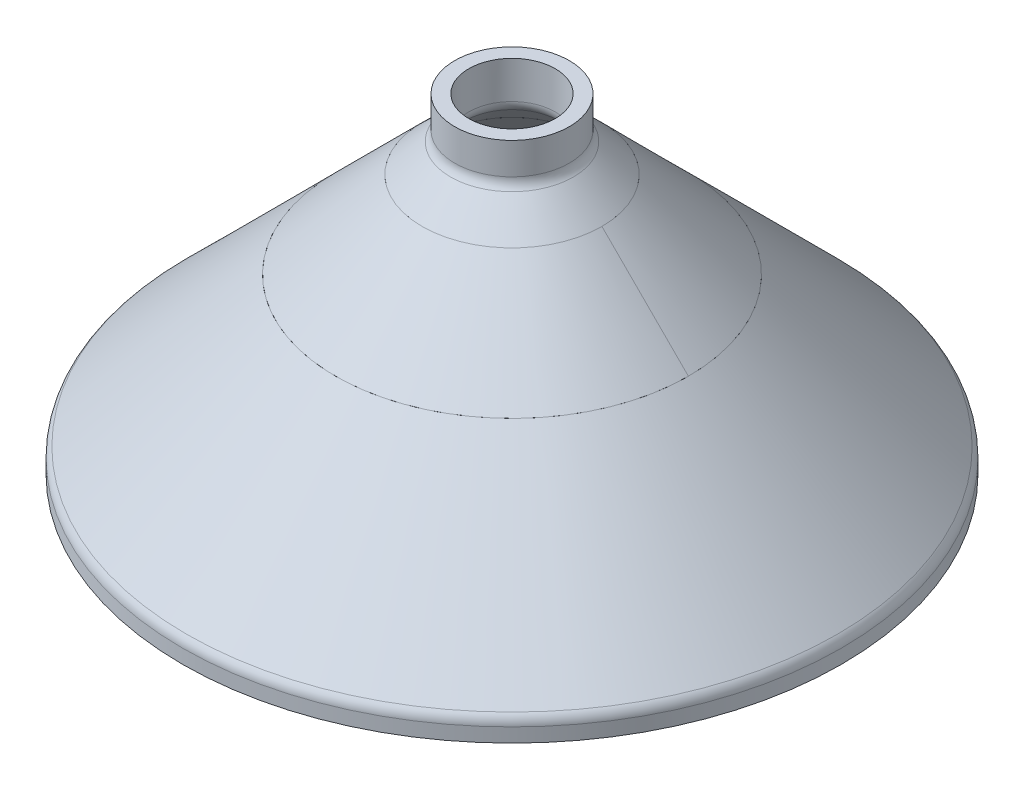
ISO-10303-21;
HEADER;
FILE_DESCRIPTION(('STEP AP214'),'2;1');
FILE_NAME('part.step','',(''),(''),'','','');
FILE_SCHEMA(('AUTOMOTIVE_DESIGN { 1 0 10303 214 1 1 1 1 }'));
ENDSEC;
DATA;
#1=APPLICATION_CONTEXT('core data for automotive mechanical design processes');
#2=APPLICATION_PROTOCOL_DEFINITION('international standard','automotive_design',2000,#1);
#3=PRODUCT_CONTEXT('',#1,'mechanical');
#4=PRODUCT('Part','Part','',(#3));
#5=PRODUCT_RELATED_PRODUCT_CATEGORY('part','',(#4));
#6=PRODUCT_DEFINITION_FORMATION('','',#4);
#7=PRODUCT_DEFINITION_CONTEXT('part definition',#1,'design');
#8=PRODUCT_DEFINITION('design','',#6,#7);
#9=PRODUCT_DEFINITION_SHAPE('','',#8);
#10=(LENGTH_UNIT() NAMED_UNIT(*) SI_UNIT(.MILLI.,.METRE.));
#11=(NAMED_UNIT(*) PLANE_ANGLE_UNIT() SI_UNIT($,.RADIAN.));
#12=(NAMED_UNIT(*) SI_UNIT($,.STERADIAN.) SOLID_ANGLE_UNIT());
#13=UNCERTAINTY_MEASURE_WITH_UNIT(LENGTH_MEASURE(1.E-05),#10,'distance_accuracy_value','');
#14=(GEOMETRIC_REPRESENTATION_CONTEXT(3) GLOBAL_UNCERTAINTY_ASSIGNED_CONTEXT((#13)) GLOBAL_UNIT_ASSIGNED_CONTEXT((#10,
#11,#12)) REPRESENTATION_CONTEXT('',''));
#15=CARTESIAN_POINT('',(0.,0.,0.));
#16=DIRECTION('',(0.,0.,1.));
#17=DIRECTION('',(1.,0.,0.));
#18=AXIS2_PLACEMENT_3D('',#15,#16,#17);
#19=CARTESIAN_POINT('',(0.,0.,0.));
#20=DIRECTION('',(0.,0.,1.));
#21=DIRECTION('',(1.,0.,0.));
#22=AXIS2_PLACEMENT_3D('',#19,#20,#21);
#23=PLANE('',#22);
#24=DIRECTION('',(-0.707106781186546,-0.707106781186549,0.));
#25=VECTOR('',#24,1.);
#26=CARTESIAN_POINT('',(0.,80.7961940777129,0.));
#27=LINE('',#26,#25);
#28=CARTESIAN_POINT('',(-40.7961940777128,40.,0.));
#29=VERTEX_POINT('',#28);
#30=CARTESIAN_POINT('',(-20.7961940777128,60.,0.));
#31=VERTEX_POINT('',#30);
#32=EDGE_CURVE('E71',#29,#31,#27,.F.);
#33=ORIENTED_EDGE('',*,*,#32,.F.);
#34=DIRECTION('',(1.,0.,0.));
#35=VECTOR('',#34,1.);
#36=CARTESIAN_POINT('',(0.,40.,0.));
#37=LINE('',#36,#35);
#38=CARTESIAN_POINT('',(-36.2000000000002,40.,0.));
#39=VERTEX_POINT('',#38);
#40=EDGE_CURVE('E100',#29,#39,#37,.T.);
#41=ORIENTED_EDGE('',*,*,#40,.T.);
#42=DIRECTION('',(-0.707106781186546,-0.707106781186549,0.));
#43=VECTOR('',#42,1.);
#44=CARTESIAN_POINT('',(0.,76.2000000000003,0.));
#45=LINE('',#44,#43);
#46=CARTESIAN_POINT('',(-16.2000000000003,60.,0.));
#47=VERTEX_POINT('',#46);
#48=EDGE_CURVE('E109',#39,#47,#45,.F.);
#49=ORIENTED_EDGE('',*,*,#48,.T.);
#50=DIRECTION('',(1.,0.,0.));
#51=VECTOR('',#50,1.);
#52=CARTESIAN_POINT('',(0.,60.,0.));
#53=LINE('',#52,#51);
#54=EDGE_CURVE('E110',#31,#47,#53,.T.);
#55=ORIENTED_EDGE('',*,*,#54,.F.);
#56=EDGE_LOOP('',(#33,#41,#49,#55));
#57=FACE_BOUND('',#56,.T.);
#58=ADVANCED_FACE('F56',(#57),#23,.T.);
#59=DIRECTION('',(-0.707106781186547,0.707106781186548,0.));
#60=VECTOR('',#59,1.);
#61=CARTESIAN_POINT('',(0.,80.7961940777129,0.));
#62=LINE('',#61,#60);
#63=CARTESIAN_POINT('',(20.7961940777129,60.,0.));
#64=VERTEX_POINT('',#63);
#65=CARTESIAN_POINT('',(40.7961940777128,40.,0.));
#66=VERTEX_POINT('',#65);
#67=EDGE_CURVE('E79',#64,#66,#62,.F.);
#68=ORIENTED_EDGE('',*,*,#67,.F.);
#69=CARTESIAN_POINT('',(16.2000000000003,60.,0.));
#70=VERTEX_POINT('',#69);
#71=EDGE_CURVE('E124',#70,#64,#53,.T.);
#72=ORIENTED_EDGE('',*,*,#71,.F.);
#73=DIRECTION('',(-0.707106781186547,0.707106781186548,0.));
#74=VECTOR('',#73,1.);
#75=CARTESIAN_POINT('',(0.,76.2000000000003,0.));
#76=LINE('',#75,#74);
#77=CARTESIAN_POINT('',(36.2000000000003,40.,0.));
#78=VERTEX_POINT('',#77);
#79=EDGE_CURVE('E114',#70,#78,#76,.F.);
#80=ORIENTED_EDGE('',*,*,#79,.T.);
#81=EDGE_CURVE('E101',#78,#66,#37,.T.);
#82=ORIENTED_EDGE('',*,*,#81,.T.);
#83=EDGE_LOOP('',(#68,#72,#80,#82));
#84=FACE_BOUND('',#83,.T.);
#85=ADVANCED_FACE('F128',(#84),#23,.T.);
#86=CARTESIAN_POINT('',(0.,60.,0.));
#87=DIRECTION('',(0.,1.,0.));
#88=DIRECTION('',(0.,0.,1.));
#89=AXIS2_PLACEMENT_3D('',#86,#87,#88);
#90=PLANE('',#89);
#91=CARTESIAN_POINT('',(0.,60.,0.));
#92=DIRECTION('',(0.,1.,0.));
#93=DIRECTION('',(0.,0.,1.));
#94=AXIS2_PLACEMENT_3D('',#91,#92,#93);
#95=CIRCLE('',#94,20.7961940777129);
#96=EDGE_CURVE('E64',#31,#64,#95,.F.);
#97=ORIENTED_EDGE('',*,*,#96,.F.);
#98=ORIENTED_EDGE('',*,*,#54,.T.);
#99=CARTESIAN_POINT('',(0.,60.,0.));
#100=DIRECTION('',(0.,1.,0.));
#101=DIRECTION('',(0.,0.,1.));
#102=AXIS2_PLACEMENT_3D('',#99,#100,#101);
#103=CIRCLE('',#102,16.2000000000003);
#104=EDGE_CURVE('E12',#47,#70,#103,.F.);
#105=ORIENTED_EDGE('',*,*,#104,.T.);
#106=ORIENTED_EDGE('',*,*,#71,.T.);
#107=EDGE_LOOP('',(#97,#98,#105,#106));
#108=FACE_BOUND('',#107,.T.);
#109=ADVANCED_FACE('F122',(#108),#90,.T.);
#110=CARTESIAN_POINT('',(0.,40.,0.));
#111=DIRECTION('',(0.,1.,0.));
#112=DIRECTION('',(0.,0.,1.));
#113=AXIS2_PLACEMENT_3D('',#110,#111,#112);
#114=PLANE('',#113);
#115=ORIENTED_EDGE('',*,*,#40,.F.);
#116=CARTESIAN_POINT('',(0.,40.,0.));
#117=DIRECTION('',(0.,1.,0.));
#118=DIRECTION('',(0.,0.,1.));
#119=AXIS2_PLACEMENT_3D('',#116,#117,#118);
#120=CIRCLE('',#119,40.7961940777128);
#121=EDGE_CURVE('E106',#29,#66,#120,.F.);
#122=ORIENTED_EDGE('',*,*,#121,.T.);
#123=ORIENTED_EDGE('',*,*,#81,.F.);
#124=CARTESIAN_POINT('',(0.,40.,0.));
#125=DIRECTION('',(0.,1.,0.));
#126=DIRECTION('',(0.,0.,1.));
#127=AXIS2_PLACEMENT_3D('',#124,#125,#126);
#128=CIRCLE('',#127,36.2000000000003);
#129=EDGE_CURVE('E97',#39,#78,#128,.F.);
#130=ORIENTED_EDGE('',*,*,#129,.F.);
#131=EDGE_LOOP('',(#115,#122,#123,#130));
#132=FACE_BOUND('',#131,.T.);
#133=ADVANCED_FACE('F98',(#132),#114,.F.);
#134=CARTESIAN_POINT('',(0.,4.59619407771267,0.));
#135=DIRECTION('',(0.,-1.,0.));
#136=DIRECTION('',(1.,0.,0.));
#137=AXIS2_PLACEMENT_3D('',#134,#135,#136);
#138=CONICAL_SURFACE('',#137,76.2,0.785398163397447);
#139=ORIENTED_EDGE('',*,*,#121,.F.);
#140=ORIENTED_EDGE('',*,*,#32,.T.);
#141=ORIENTED_EDGE('',*,*,#96,.T.);
#142=ORIENTED_EDGE('',*,*,#67,.T.);
#143=EDGE_LOOP('',(#139,#140,#141,#142));
#144=FACE_BOUND('',#143,.T.);
#145=ADVANCED_FACE('F58',(#144),#138,.T.);
#146=CARTESIAN_POINT('',(0.,3.25000000000006,0.));
#147=DIRECTION('',(0.,-1.,0.));
#148=DIRECTION('',(1.,0.,0.));
#149=AXIS2_PLACEMENT_3D('',#146,#147,#148);
#150=CONICAL_SURFACE('',#149,72.9500000000001,0.785398163397447);
#151=ORIENTED_EDGE('',*,*,#48,.F.);
#152=ORIENTED_EDGE('',*,*,#129,.T.);
#153=ORIENTED_EDGE('',*,*,#79,.F.);
#154=ORIENTED_EDGE('',*,*,#104,.F.);
#155=EDGE_LOOP('',(#151,#152,#153,#154));
#156=FACE_BOUND('',#155,.T.);
#157=ADVANCED_FACE('F112',(#156),#150,.F.);
#158=CLOSED_SHELL('',(#58,#85,#109,#133,#145,#157));
#159=MANIFOLD_SOLID_BREP('B2',#158);
#160=CARTESIAN_POINT('',(0.,0.,0.));
#161=DIRECTION('',(0.,0.,1.));
#162=DIRECTION('',(1.,0.,0.));
#163=AXIS2_PLACEMENT_3D('',#160,#161,#162);
#164=PLANE('',#163);
#165=DIRECTION('',(-0.707106781186546,-0.707106781186549,0.));
#166=VECTOR('',#165,1.);
#167=CARTESIAN_POINT('',(0.,80.7961940777129,0.));
#168=LINE('',#167,#166);
#169=CARTESIAN_POINT('',(-40.7961940777128,40.,0.));
#170=VERTEX_POINT('',#169);
#171=CARTESIAN_POINT('',(-20.7961940777128,60.,0.));
#172=VERTEX_POINT('',#171);
#173=EDGE_CURVE('E181',#170,#172,#168,.F.);
#174=ORIENTED_EDGE('',*,*,#173,.T.);
#175=DIRECTION('',(1.,0.,0.));
#176=VECTOR('',#175,1.);
#177=CARTESIAN_POINT('',(0.,60.,0.));
#178=LINE('',#177,#176);
#179=CARTESIAN_POINT('',(-16.2000000000003,60.,0.));
#180=VERTEX_POINT('',#179);
#181=EDGE_CURVE('E222',#172,#180,#178,.T.);
#182=ORIENTED_EDGE('',*,*,#181,.T.);
#183=DIRECTION('',(-0.707106781186546,-0.707106781186549,0.));
#184=VECTOR('',#183,1.);
#185=CARTESIAN_POINT('',(0.,76.2000000000003,0.));
#186=LINE('',#185,#184);
#187=CARTESIAN_POINT('',(-36.2000000000002,40.,0.));
#188=VERTEX_POINT('',#187);
#189=EDGE_CURVE('E225',#188,#180,#186,.F.);
#190=ORIENTED_EDGE('',*,*,#189,.F.);
#191=DIRECTION('',(1.,0.,0.));
#192=VECTOR('',#191,1.);
#193=CARTESIAN_POINT('',(0.,40.,0.));
#194=LINE('',#193,#192);
#195=EDGE_CURVE('E192',#170,#188,#194,.T.);
#196=ORIENTED_EDGE('',*,*,#195,.F.);
#197=EDGE_LOOP('',(#174,#182,#190,#196));
#198=FACE_BOUND('',#197,.T.);
#199=ADVANCED_FACE('F177',(#198),#164,.F.);
#200=DIRECTION('',(-0.707106781186547,0.707106781186548,0.));
#201=VECTOR('',#200,1.);
#202=CARTESIAN_POINT('',(0.,80.7961940777129,0.));
#203=LINE('',#202,#201);
#204=CARTESIAN_POINT('',(20.7961940777129,60.,0.));
#205=VERTEX_POINT('',#204);
#206=CARTESIAN_POINT('',(40.7961940777128,40.,0.));
#207=VERTEX_POINT('',#206);
#208=EDGE_CURVE('E54',#205,#207,#203,.F.);
#209=ORIENTED_EDGE('',*,*,#208,.T.);
#210=CARTESIAN_POINT('',(36.2000000000003,40.,0.));
#211=VERTEX_POINT('',#210);
#212=EDGE_CURVE('E200',#211,#207,#194,.T.);
#213=ORIENTED_EDGE('',*,*,#212,.F.);
#214=DIRECTION('',(-0.707106781186547,0.707106781186548,0.));
#215=VECTOR('',#214,1.);
#216=CARTESIAN_POINT('',(0.,76.2000000000003,0.));
#217=LINE('',#216,#215);
#218=CARTESIAN_POINT('',(16.2000000000003,60.,0.));
#219=VERTEX_POINT('',#218);
#220=EDGE_CURVE('E229',#219,#211,#217,.F.);
#221=ORIENTED_EDGE('',*,*,#220,.F.);
#222=EDGE_CURVE('E242',#219,#205,#178,.T.);
#223=ORIENTED_EDGE('',*,*,#222,.T.);
#224=EDGE_LOOP('',(#209,#213,#221,#223));
#225=FACE_BOUND('',#224,.T.);
#226=ADVANCED_FACE('F179',(#225),#164,.F.);
#227=CARTESIAN_POINT('',(0.,60.,0.));
#228=DIRECTION('',(0.,1.,0.));
#229=DIRECTION('',(0.,0.,1.));
#230=AXIS2_PLACEMENT_3D('',#227,#228,#229);
#231=PLANE('',#230);
#232=ORIENTED_EDGE('',*,*,#181,.F.);
#233=CARTESIAN_POINT('',(0.,60.,0.));
#234=DIRECTION('',(0.,1.,0.));
#235=DIRECTION('',(0.,0.,1.));
#236=AXIS2_PLACEMENT_3D('',#233,#234,#235);
#237=CIRCLE('',#236,20.7961940777129);
#238=EDGE_CURVE('E235',#205,#172,#237,.F.);
#239=ORIENTED_EDGE('',*,*,#238,.F.);
#240=ORIENTED_EDGE('',*,*,#222,.F.);
#241=CARTESIAN_POINT('',(0.,60.,0.));
#242=DIRECTION('',(0.,1.,0.));
#243=DIRECTION('',(0.,0.,1.));
#244=AXIS2_PLACEMENT_3D('',#241,#242,#243);
#245=CIRCLE('',#244,16.2000000000003);
#246=EDGE_CURVE('E240',#219,#180,#245,.F.);
#247=ORIENTED_EDGE('',*,*,#246,.T.);
#248=EDGE_LOOP('',(#232,#239,#240,#247));
#249=FACE_BOUND('',#248,.T.);
#250=ADVANCED_FACE('F249',(#249),#231,.T.);
#251=CARTESIAN_POINT('',(0.,40.,0.));
#252=DIRECTION('',(0.,1.,0.));
#253=DIRECTION('',(0.,0.,1.));
#254=AXIS2_PLACEMENT_3D('',#251,#252,#253);
#255=PLANE('',#254);
#256=CARTESIAN_POINT('',(0.,40.,0.));
#257=DIRECTION('',(0.,1.,0.));
#258=DIRECTION('',(0.,0.,1.));
#259=AXIS2_PLACEMENT_3D('',#256,#257,#258);
#260=CIRCLE('',#259,40.7961940777128);
#261=EDGE_CURVE('E221',#207,#170,#260,.F.);
#262=ORIENTED_EDGE('',*,*,#261,.T.);
#263=ORIENTED_EDGE('',*,*,#195,.T.);
#264=CARTESIAN_POINT('',(0.,40.,0.));
#265=DIRECTION('',(0.,1.,0.));
#266=DIRECTION('',(0.,0.,1.));
#267=AXIS2_PLACEMENT_3D('',#264,#265,#266);
#268=CIRCLE('',#267,36.2000000000003);
#269=EDGE_CURVE('E219',#211,#188,#268,.F.);
#270=ORIENTED_EDGE('',*,*,#269,.F.);
#271=ORIENTED_EDGE('',*,*,#212,.T.);
#272=EDGE_LOOP('',(#262,#263,#270,#271));
#273=FACE_BOUND('',#272,.T.);
#274=ADVANCED_FACE('F217',(#273),#255,.F.);
#275=CARTESIAN_POINT('',(0.,3.25000000000006,0.));
#276=DIRECTION('',(0.,-1.,0.));
#277=DIRECTION('',(1.,0.,0.));
#278=AXIS2_PLACEMENT_3D('',#275,#276,#277);
#279=CONICAL_SURFACE('',#278,72.9500000000001,0.785398163397447);
#280=ORIENTED_EDGE('',*,*,#269,.T.);
#281=ORIENTED_EDGE('',*,*,#189,.T.);
#282=ORIENTED_EDGE('',*,*,#246,.F.);
#283=ORIENTED_EDGE('',*,*,#220,.T.);
#284=EDGE_LOOP('',(#280,#281,#282,#283));
#285=FACE_BOUND('',#284,.T.);
#286=ADVANCED_FACE('F231',(#285),#279,.F.);
#287=CARTESIAN_POINT('',(0.,4.59619407771267,0.));
#288=DIRECTION('',(0.,-1.,0.));
#289=DIRECTION('',(1.,0.,0.));
#290=AXIS2_PLACEMENT_3D('',#287,#288,#289);
#291=CONICAL_SURFACE('',#290,76.2,0.785398163397447);
#292=ORIENTED_EDGE('',*,*,#173,.F.);
#293=ORIENTED_EDGE('',*,*,#261,.F.);
#294=ORIENTED_EDGE('',*,*,#208,.F.);
#295=ORIENTED_EDGE('',*,*,#238,.T.);
#296=EDGE_LOOP('',(#292,#293,#294,#295));
#297=FACE_BOUND('',#296,.T.);
#298=ADVANCED_FACE('F247',(#297),#291,.T.);
#299=CLOSED_SHELL('',(#199,#226,#250,#274,#286,#298));
#300=MANIFOLD_SOLID_BREP('B6',#299);
#301=CARTESIAN_POINT('',(0.,40.,0.));
#302=DIRECTION('',(0.,1.,0.));
#303=DIRECTION('',(0.,0.,1.));
#304=AXIS2_PLACEMENT_3D('',#301,#302,#303);
#305=PLANE('',#304);
#306=CARTESIAN_POINT('',(0.,40.,0.));
#307=DIRECTION('',(0.,1.,0.));
#308=DIRECTION('',(0.,0.,1.));
#309=AXIS2_PLACEMENT_3D('',#306,#307,#308);
#310=CIRCLE('',#309,36.2000000000003);
#311=CARTESIAN_POINT('',(0.,40.,36.2000000000003));
#312=VERTEX_POINT('',#311);
#313=EDGE_CURVE('E300',#312,#312,#310,.F.);
#314=ORIENTED_EDGE('',*,*,#313,.T.);
#315=EDGE_LOOP('',(#314));
#316=FACE_BOUND('',#315,.T.);
#317=CARTESIAN_POINT('',(0.,40.,0.));
#318=DIRECTION('',(0.,1.,0.));
#319=DIRECTION('',(0.,0.,1.));
#320=AXIS2_PLACEMENT_3D('',#317,#318,#319);
#321=CIRCLE('',#320,40.7961940777128);
#322=CARTESIAN_POINT('',(0.,40.,40.7961940777128));
#323=VERTEX_POINT('',#322);
#324=EDGE_CURVE('E314',#323,#323,#321,.F.);
#325=ORIENTED_EDGE('',*,*,#324,.F.);
#326=EDGE_LOOP('',(#325));
#327=FACE_BOUND('',#326,.T.);
#328=ADVANCED_FACE('F296',(#316,#327),#305,.T.);
#329=CARTESIAN_POINT('',(0.,0.,0.));
#330=DIRECTION('',(0.,1.,0.));
#331=DIRECTION('',(-1.,0.,0.));
#332=AXIS2_PLACEMENT_3D('',#329,#330,#331);
#333=PLANE('',#332);
#334=CARTESIAN_POINT('',(0.,0.,0.));
#335=DIRECTION('',(0.,-1.,0.));
#336=DIRECTION('',(1.,0.,0.));
#337=AXIS2_PLACEMENT_3D('',#334,#335,#336);
#338=CIRCLE('',#337,72.9500000000001);
#339=CARTESIAN_POINT('',(72.9500000000001,0.,0.));
#340=VERTEX_POINT('',#339);
#341=EDGE_CURVE('E176',#340,#340,#338,.T.);
#342=ORIENTED_EDGE('',*,*,#341,.F.);
#343=EDGE_LOOP('',(#342));
#344=FACE_BOUND('',#343,.T.);
#345=CARTESIAN_POINT('',(0.,0.,0.));
#346=DIRECTION('',(0.,-1.,0.));
#347=DIRECTION('',(1.,0.,0.));
#348=AXIS2_PLACEMENT_3D('',#345,#346,#347);
#349=CIRCLE('',#348,76.2);
#350=CARTESIAN_POINT('',(76.2000000000001,0.,0.));
#351=VERTEX_POINT('',#350);
#352=EDGE_CURVE('E305',#351,#351,#349,.T.);
#353=ORIENTED_EDGE('',*,*,#352,.T.);
#354=EDGE_LOOP('',(#353));
#355=FACE_BOUND('',#354,.T.);
#356=ADVANCED_FACE('F344',(#344,#355),#333,.F.);
#357=CARTESIAN_POINT('',(0.,0.,0.));
#358=DIRECTION('',(0.,-1.,0.));
#359=DIRECTION('',(1.,0.,0.));
#360=AXIS2_PLACEMENT_3D('',#357,#358,#359);
#361=CYLINDRICAL_SURFACE('',#360,76.2);
#362=CARTESIAN_POINT('',(0.,3.25000000000012,0.));
#363=DIRECTION('',(0.,1.,0.));
#364=DIRECTION('',(-1.,0.,0.));
#365=AXIS2_PLACEMENT_3D('',#362,#363,#364);
#366=CIRCLE('',#365,76.2);
#367=CARTESIAN_POINT('',(-76.2,3.2500000000001,0.));
#368=VERTEX_POINT('',#367);
#369=EDGE_CURVE('E311',#368,#368,#366,.F.);
#370=ORIENTED_EDGE('',*,*,#369,.T.);
#371=EDGE_LOOP('',(#370));
#372=FACE_BOUND('',#371,.T.);
#373=ORIENTED_EDGE('',*,*,#352,.F.);
#374=EDGE_LOOP('',(#373));
#375=FACE_BOUND('',#374,.T.);
#376=ADVANCED_FACE('F346',(#372,#375),#361,.T.);
#377=CARTESIAN_POINT('',(0.,3.25000000000012,0.));
#378=DIRECTION('',(0.,1.,0.));
#379=DIRECTION('',(-1.,0.,0.));
#380=AXIS2_PLACEMENT_3D('',#377,#378,#379);
#381=TOROIDAL_SURFACE('',#380,72.95,3.25);
#382=ORIENTED_EDGE('',*,*,#369,.F.);
#383=EDGE_LOOP('',(#382));
#384=FACE_BOUND('',#383,.T.);
#385=CARTESIAN_POINT('',(0.,5.54809703885639,0.));
#386=DIRECTION('',(0.,1.,0.));
#387=DIRECTION('',(-1.,0.,0.));
#388=AXIS2_PLACEMENT_3D('',#385,#386,#387);
#389=CIRCLE('',#388,75.2480970388563);
#390=CARTESIAN_POINT('',(-75.2480970388563,5.54809703885637,0.));
#391=VERTEX_POINT('',#390);
#392=EDGE_CURVE('E375',#391,#391,#389,.T.);
#393=ORIENTED_EDGE('',*,*,#392,.F.);
#394=EDGE_LOOP('',(#393));
#395=FACE_BOUND('',#394,.T.);
#396=ADVANCED_FACE('F353',(#384,#395),#381,.T.);
#397=CARTESIAN_POINT('',(0.,4.59619407771267,0.));
#398=DIRECTION('',(0.,-1.,0.));
#399=DIRECTION('',(1.,0.,0.));
#400=AXIS2_PLACEMENT_3D('',#397,#398,#399);
#401=CONICAL_SURFACE('',#400,76.2,0.785398163397447);
#402=ORIENTED_EDGE('',*,*,#392,.T.);
#403=EDGE_LOOP('',(#402));
#404=FACE_BOUND('',#403,.T.);
#405=ORIENTED_EDGE('',*,*,#324,.T.);
#406=EDGE_LOOP('',(#405));
#407=FACE_BOUND('',#406,.T.);
#408=ADVANCED_FACE('F298',(#404,#407),#401,.T.);
#409=CARTESIAN_POINT('',(0.,0.,0.));
#410=DIRECTION('',(0.,-1.,0.));
#411=DIRECTION('',(1.,0.,0.));
#412=AXIS2_PLACEMENT_3D('',#409,#410,#411);
#413=CYLINDRICAL_SURFACE('',#412,72.9500000000001);
#414=CARTESIAN_POINT('',(0.,1.90380592228751,0.));
#415=DIRECTION('',(0.,-1.,0.));
#416=DIRECTION('',(1.,0.,0.));
#417=AXIS2_PLACEMENT_3D('',#414,#415,#416);
#418=CIRCLE('',#417,72.9500000000001);
#419=CARTESIAN_POINT('',(72.9500000000001,1.90380592228753,0.));
#420=VERTEX_POINT('',#419);
#421=EDGE_CURVE('E317',#420,#420,#418,.F.);
#422=ORIENTED_EDGE('',*,*,#421,.T.);
#423=EDGE_LOOP('',(#422));
#424=FACE_BOUND('',#423,.T.);
#425=ORIENTED_EDGE('',*,*,#341,.T.);
#426=EDGE_LOOP('',(#425));
#427=FACE_BOUND('',#426,.T.);
#428=ADVANCED_FACE('F338',(#424,#427),#413,.F.);
#429=CARTESIAN_POINT('',(0.,1.90380592228751,0.));
#430=DIRECTION('',(0.,-1.,0.));
#431=DIRECTION('',(1.,0.,0.));
#432=AXIS2_PLACEMENT_3D('',#429,#430,#431);
#433=TOROIDAL_SURFACE('',#432,69.7000000000001,3.25);
#434=CARTESIAN_POINT('',(0.,4.20190296114377,0.));
#435=DIRECTION('',(0.,-1.,0.));
#436=DIRECTION('',(1.,0.,0.));
#437=AXIS2_PLACEMENT_3D('',#434,#435,#436);
#438=CIRCLE('',#437,71.9980970388563);
#439=CARTESIAN_POINT('',(71.9980970388564,4.20190296114379,0.));
#440=VERTEX_POINT('',#439);
#441=EDGE_CURVE('E323',#440,#440,#438,.T.);
#442=ORIENTED_EDGE('',*,*,#441,.F.);
#443=EDGE_LOOP('',(#442));
#444=FACE_BOUND('',#443,.T.);
#445=ORIENTED_EDGE('',*,*,#421,.F.);
#446=EDGE_LOOP('',(#445));
#447=FACE_BOUND('',#446,.T.);
#448=ADVANCED_FACE('F332',(#444,#447),#433,.F.);
#449=CARTESIAN_POINT('',(0.,3.25000000000006,0.));
#450=DIRECTION('',(0.,-1.,0.));
#451=DIRECTION('',(1.,0.,0.));
#452=AXIS2_PLACEMENT_3D('',#449,#450,#451);
#453=CONICAL_SURFACE('',#452,72.9500000000001,0.785398163397447);
#454=ORIENTED_EDGE('',*,*,#441,.T.);
#455=EDGE_LOOP('',(#454));
#456=FACE_BOUND('',#455,.T.);
#457=ORIENTED_EDGE('',*,*,#313,.F.);
#458=EDGE_LOOP('',(#457));
#459=FACE_BOUND('',#458,.T.);
#460=ADVANCED_FACE('F330',(#456,#459),#453,.F.);
#461=CLOSED_SHELL('',(#328,#356,#376,#396,#408,#428,#448,#460));
#462=MANIFOLD_SOLID_BREP('B48',#461);
#463=CARTESIAN_POINT('',(0.,60.,0.));
#464=DIRECTION('',(0.,1.,0.));
#465=DIRECTION('',(0.,0.,1.));
#466=AXIS2_PLACEMENT_3D('',#463,#464,#465);
#467=PLANE('',#466);
#468=CARTESIAN_POINT('',(0.,60.,0.));
#469=DIRECTION('',(0.,1.,0.));
#470=DIRECTION('',(0.,0.,1.));
#471=AXIS2_PLACEMENT_3D('',#468,#469,#470);
#472=CIRCLE('',#471,20.7961940777129);
#473=CARTESIAN_POINT('',(0.,60.,20.7961940777129));
#474=VERTEX_POINT('',#473);
#475=EDGE_CURVE('E295',#474,#474,#472,.F.);
#476=ORIENTED_EDGE('',*,*,#475,.T.);
#477=EDGE_LOOP('',(#476));
#478=FACE_BOUND('',#477,.T.);
#479=CARTESIAN_POINT('',(0.,60.,0.));
#480=DIRECTION('',(0.,1.,0.));
#481=DIRECTION('',(0.,0.,1.));
#482=AXIS2_PLACEMENT_3D('',#479,#480,#481);
#483=CIRCLE('',#482,16.2000000000003);
#484=CARTESIAN_POINT('',(0.,60.,16.2000000000003));
#485=VERTEX_POINT('',#484);
#486=EDGE_CURVE('E426',#485,#485,#483,.F.);
#487=ORIENTED_EDGE('',*,*,#486,.F.);
#488=EDGE_LOOP('',(#487));
#489=FACE_BOUND('',#488,.T.);
#490=ADVANCED_FACE('F423',(#478,#489),#467,.F.);
#491=CARTESIAN_POINT('',(0.,67.5461940777129,0.));
#492=DIRECTION('',(0.,1.,0.));
#493=DIRECTION('',(-1.,0.,0.));
#494=AXIS2_PLACEMENT_3D('',#491,#492,#493);
#495=TOROIDAL_SURFACE('',#494,13.25,3.25);
#496=CARTESIAN_POINT('',(0.,67.5461940777129,0.));
#497=DIRECTION('',(0.,1.,0.));
#498=DIRECTION('',(-1.,0.,0.));
#499=AXIS2_PLACEMENT_3D('',#496,#497,#498);
#500=CIRCLE('',#499,10.);
#501=CARTESIAN_POINT('',(-10.,67.5461940777129,0.));
#502=VERTEX_POINT('',#501);
#503=EDGE_CURVE('E437',#502,#502,#500,.F.);
#504=ORIENTED_EDGE('',*,*,#503,.F.);
#505=EDGE_LOOP('',(#504));
#506=FACE_BOUND('',#505,.T.);
#507=CARTESIAN_POINT('',(0.,65.2480970388566,0.));
#508=DIRECTION('',(0.,-1.,0.));
#509=DIRECTION('',(1.,0.,0.));
#510=AXIS2_PLACEMENT_3D('',#507,#508,#509);
#511=CIRCLE('',#510,10.9519029611437);
#512=CARTESIAN_POINT('',(10.9519029611437,65.2480970388566,0.));
#513=VERTEX_POINT('',#512);
#514=EDGE_CURVE('E433',#513,#513,#511,.F.);
#515=ORIENTED_EDGE('',*,*,#514,.F.);
#516=EDGE_LOOP('',(#515));
#517=FACE_BOUND('',#516,.T.);
#518=ADVANCED_FACE('F471',(#506,#517),#495,.T.);
#519=CARTESIAN_POINT('',(0.,68.8923881554254,0.));
#520=DIRECTION('',(0.,-1.,0.));
#521=DIRECTION('',(1.,0.,0.));
#522=AXIS2_PLACEMENT_3D('',#519,#520,#521);
#523=TOROIDAL_SURFACE('',#522,16.5,3.25);
#524=CARTESIAN_POINT('',(0.,66.5942911165692,0.));
#525=DIRECTION('',(0.,1.,0.));
#526=DIRECTION('',(-1.,0.,0.));
#527=AXIS2_PLACEMENT_3D('',#524,#525,#526);
#528=CIRCLE('',#527,14.2019029611437);
#529=CARTESIAN_POINT('',(-14.2019029611437,66.5942911165692,0.));
#530=VERTEX_POINT('',#529);
#531=EDGE_CURVE('E443',#530,#530,#528,.F.);
#532=ORIENTED_EDGE('',*,*,#531,.F.);
#533=EDGE_LOOP('',(#532));
#534=FACE_BOUND('',#533,.T.);
#535=CARTESIAN_POINT('',(0.,68.8923881554254,0.));
#536=DIRECTION('',(0.,-1.,0.));
#537=DIRECTION('',(1.,0.,0.));
#538=AXIS2_PLACEMENT_3D('',#535,#536,#537);
#539=CIRCLE('',#538,13.25);
#540=CARTESIAN_POINT('',(13.25,68.8923881554254,0.));
#541=VERTEX_POINT('',#540);
#542=EDGE_CURVE('E440',#541,#541,#539,.F.);
#543=ORIENTED_EDGE('',*,*,#542,.F.);
#544=EDGE_LOOP('',(#543));
#545=FACE_BOUND('',#544,.T.);
#546=ADVANCED_FACE('F477',(#534,#545),#523,.F.);
#547=CARTESIAN_POINT('',(0.,3.25000000000006,0.));
#548=DIRECTION('',(0.,-1.,0.));
#549=DIRECTION('',(1.,0.,0.));
#550=AXIS2_PLACEMENT_3D('',#547,#548,#549);
#551=CONICAL_SURFACE('',#550,72.9500000000001,0.785398163397447);
#552=ORIENTED_EDGE('',*,*,#486,.T.);
#553=EDGE_LOOP('',(#552));
#554=FACE_BOUND('',#553,.T.);
#555=ORIENTED_EDGE('',*,*,#514,.T.);
#556=EDGE_LOOP('',(#555));
#557=FACE_BOUND('',#556,.T.);
#558=ADVANCED_FACE('F467',(#554,#557),#551,.F.);
#559=CARTESIAN_POINT('',(0.,0.,0.));
#560=DIRECTION('',(0.,-1.,0.));
#561=DIRECTION('',(1.,0.,0.));
#562=AXIS2_PLACEMENT_3D('',#559,#560,#561);
#563=CYLINDRICAL_SURFACE('',#562,10.);
#564=ORIENTED_EDGE('',*,*,#503,.T.);
#565=EDGE_LOOP('',(#564));
#566=FACE_BOUND('',#565,.T.);
#567=CARTESIAN_POINT('',(0.,76.2000000000003,0.));
#568=DIRECTION('',(0.,-1.,0.));
#569=DIRECTION('',(1.,0.,0.));
#570=AXIS2_PLACEMENT_3D('',#567,#568,#569);
#571=CIRCLE('',#570,10.);
#572=CARTESIAN_POINT('',(10.,76.2000000000003,0.));
#573=VERTEX_POINT('',#572);
#574=EDGE_CURVE('E446',#573,#573,#571,.T.);
#575=ORIENTED_EDGE('',*,*,#574,.F.);
#576=EDGE_LOOP('',(#575));
#577=FACE_BOUND('',#576,.T.);
#578=ADVANCED_FACE('F457',(#566,#577),#563,.F.);
#579=CARTESIAN_POINT('',(0.,76.2000000000003,0.));
#580=DIRECTION('',(0.,1.,0.));
#581=DIRECTION('',(-1.,0.,0.));
#582=AXIS2_PLACEMENT_3D('',#579,#580,#581);
#583=PLANE('',#582);
#584=ORIENTED_EDGE('',*,*,#574,.T.);
#585=EDGE_LOOP('',(#584));
#586=FACE_BOUND('',#585,.T.);
#587=CARTESIAN_POINT('',(0.,76.2000000000003,0.));
#588=DIRECTION('',(0.,-1.,0.));
#589=DIRECTION('',(1.,0.,0.));
#590=AXIS2_PLACEMENT_3D('',#587,#588,#589);
#591=CIRCLE('',#590,13.25);
#592=CARTESIAN_POINT('',(13.25,76.2000000000003,0.));
#593=VERTEX_POINT('',#592);
#594=EDGE_CURVE('E449',#593,#593,#591,.T.);
#595=ORIENTED_EDGE('',*,*,#594,.F.);
#596=EDGE_LOOP('',(#595));
#597=FACE_BOUND('',#596,.T.);
#598=ADVANCED_FACE('F455',(#586,#597),#583,.T.);
#599=CARTESIAN_POINT('',(0.,0.,0.));
#600=DIRECTION('',(0.,-1.,0.));
#601=DIRECTION('',(1.,0.,0.));
#602=AXIS2_PLACEMENT_3D('',#599,#600,#601);
#603=CYLINDRICAL_SURFACE('',#602,13.25);
#604=ORIENTED_EDGE('',*,*,#542,.T.);
#605=EDGE_LOOP('',(#604));
#606=FACE_BOUND('',#605,.T.);
#607=ORIENTED_EDGE('',*,*,#594,.T.);
#608=EDGE_LOOP('',(#607));
#609=FACE_BOUND('',#608,.T.);
#610=ADVANCED_FACE('F453',(#606,#609),#603,.T.);
#611=CARTESIAN_POINT('',(0.,4.59619407771267,0.));
#612=DIRECTION('',(0.,-1.,0.));
#613=DIRECTION('',(1.,0.,0.));
#614=AXIS2_PLACEMENT_3D('',#611,#612,#613);
#615=CONICAL_SURFACE('',#614,76.2,0.785398163397447);
#616=ORIENTED_EDGE('',*,*,#475,.F.);
#617=EDGE_LOOP('',(#616));
#618=FACE_BOUND('',#617,.T.);
#619=ORIENTED_EDGE('',*,*,#531,.T.);
#620=EDGE_LOOP('',(#619));
#621=FACE_BOUND('',#620,.T.);
#622=ADVANCED_FACE('F463',(#618,#621),#615,.T.);
#623=CLOSED_SHELL('',(#490,#518,#546,#558,#578,#598,#610,#622));
#624=MANIFOLD_SOLID_BREP('B171',#623);
#625=ADVANCED_BREP_SHAPE_REPRESENTATION('',(#18,#159,#300,#462,#624),#14);
#626=SHAPE_DEFINITION_REPRESENTATION(#9,#625);
ENDSEC;
END-ISO-10303-21;
